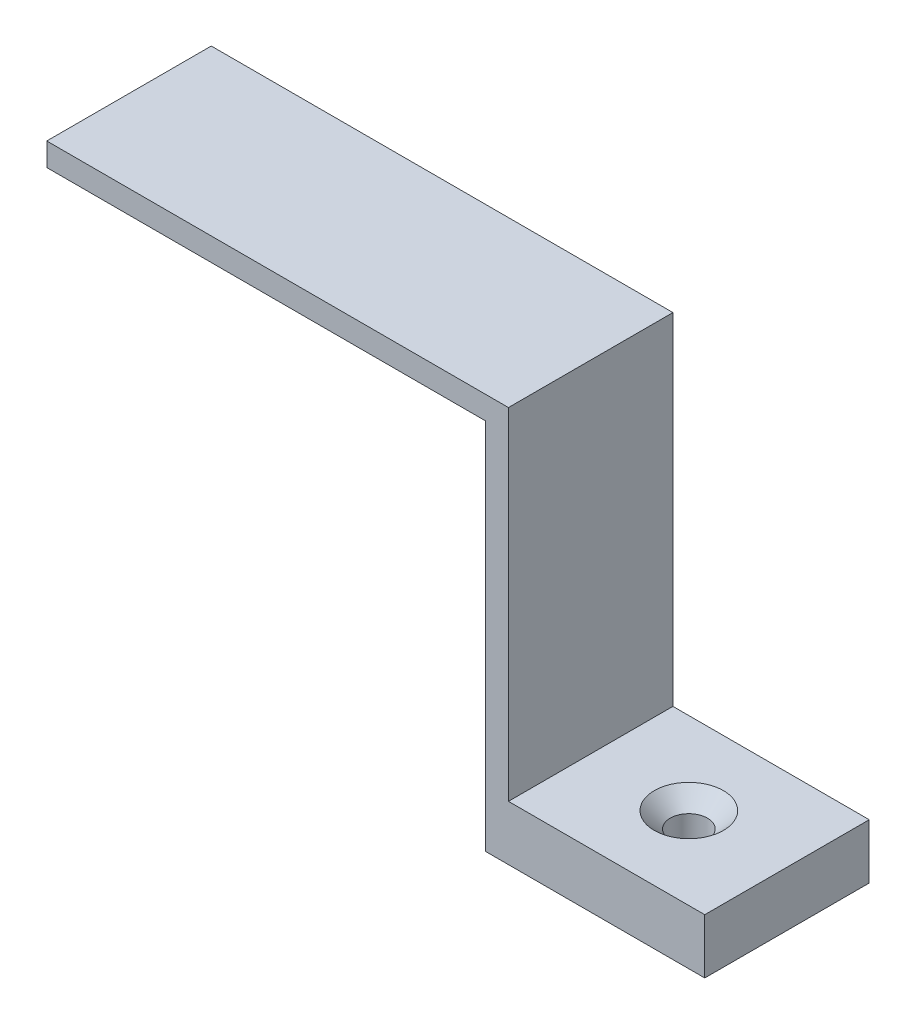
ISO-10303-21;
HEADER;
FILE_DESCRIPTION(('STEP AP214'),'2;1');
FILE_NAME('part.step','',(''),(''),'','','');
FILE_SCHEMA(('AUTOMOTIVE_DESIGN { 1 0 10303 214 1 1 1 1 }'));
ENDSEC;
DATA;
#1=APPLICATION_CONTEXT('core data for automotive mechanical design processes');
#2=APPLICATION_PROTOCOL_DEFINITION('international standard','automotive_design',2000,#1);
#3=PRODUCT_CONTEXT('',#1,'mechanical');
#4=PRODUCT('Part','Part','',(#3));
#5=PRODUCT_RELATED_PRODUCT_CATEGORY('part','',(#4));
#6=PRODUCT_DEFINITION_FORMATION('','',#4);
#7=PRODUCT_DEFINITION_CONTEXT('part definition',#1,'design');
#8=PRODUCT_DEFINITION('design','',#6,#7);
#9=PRODUCT_DEFINITION_SHAPE('','',#8);
#10=(LENGTH_UNIT() NAMED_UNIT(*) SI_UNIT(.MILLI.,.METRE.));
#11=(NAMED_UNIT(*) PLANE_ANGLE_UNIT() SI_UNIT($,.RADIAN.));
#12=(NAMED_UNIT(*) SI_UNIT($,.STERADIAN.) SOLID_ANGLE_UNIT());
#13=UNCERTAINTY_MEASURE_WITH_UNIT(LENGTH_MEASURE(1.E-05),#10,'distance_accuracy_value','');
#14=(GEOMETRIC_REPRESENTATION_CONTEXT(3) GLOBAL_UNCERTAINTY_ASSIGNED_CONTEXT((#13)) GLOBAL_UNIT_ASSIGNED_CONTEXT((#10,
#11,#12)) REPRESENTATION_CONTEXT('',''));
#15=CARTESIAN_POINT('',(0.,0.,0.));
#16=DIRECTION('',(0.,0.,1.));
#17=DIRECTION('',(1.,0.,0.));
#18=AXIS2_PLACEMENT_3D('',#15,#16,#17);
#19=CARTESIAN_POINT('',(-42.1778195773857,-18.7791958041958,15.));
#20=DIRECTION('',(0.,-1.,0.));
#21=DIRECTION('',(0.,0.,-1.));
#22=AXIS2_PLACEMENT_3D('',#19,#20,#21);
#23=PLANE('',#22);
#24=CARTESIAN_POINT('',(-33.2278195773857,-18.7791958041958,7.5));
#25=DIRECTION('',(0.,1.,0.));
#26=DIRECTION('',(0.,0.,1.));
#27=AXIS2_PLACEMENT_3D('',#24,#25,#26);
#28=CIRCLE('',#27,3.15);
#29=CARTESIAN_POINT('',(-33.2278195773857,-18.7791958041958,10.65));
#30=VERTEX_POINT('',#29);
#31=EDGE_CURVE('E182',#30,#30,#28,.T.);
#32=ORIENTED_EDGE('',*,*,#31,.F.);
#33=EDGE_LOOP('',(#32));
#34=FACE_BOUND('',#33,.T.);
#35=DIRECTION('',(-1.,0.,0.));
#36=VECTOR('',#35,1.);
#37=CARTESIAN_POINT('',(-42.1778195773857,-18.7791958041958,0.));
#38=LINE('',#37,#36);
#39=CARTESIAN_POINT('',(-24.2778195773857,-18.7791958041958,0.));
#40=VERTEX_POINT('',#39);
#41=CARTESIAN_POINT('',(-42.1778195773857,-18.7791958041958,0.));
#42=VERTEX_POINT('',#41);
#43=EDGE_CURVE('E129',#40,#42,#38,.T.);
#44=ORIENTED_EDGE('',*,*,#43,.T.);
#45=DIRECTION('',(0.,0.,-1.));
#46=VECTOR('',#45,1.);
#47=CARTESIAN_POINT('',(-42.1778195773857,-18.7791958041958,15.));
#48=LINE('',#47,#46);
#49=CARTESIAN_POINT('',(-42.1778195773857,-18.7791958041958,15.));
#50=VERTEX_POINT('',#49);
#51=EDGE_CURVE('E11',#50,#42,#48,.T.);
#52=ORIENTED_EDGE('',*,*,#51,.F.);
#53=DIRECTION('',(-1.,0.,0.));
#54=VECTOR('',#53,1.);
#55=CARTESIAN_POINT('',(-42.1778195773857,-18.7791958041958,15.));
#56=LINE('',#55,#54);
#57=CARTESIAN_POINT('',(-24.2778195773857,-18.7791958041958,15.));
#58=VERTEX_POINT('',#57);
#59=EDGE_CURVE('E144',#58,#50,#56,.T.);
#60=ORIENTED_EDGE('',*,*,#59,.F.);
#61=DIRECTION('',(0.,0.,-1.));
#62=VECTOR('',#61,1.);
#63=CARTESIAN_POINT('',(-24.2778195773857,-18.7791958041958,15.));
#64=LINE('',#63,#62);
#65=EDGE_CURVE('E125',#58,#40,#64,.T.);
#66=ORIENTED_EDGE('',*,*,#65,.T.);
#67=EDGE_LOOP('',(#44,#52,#60,#66));
#68=FACE_BOUND('',#67,.T.);
#69=ADVANCED_FACE('F33',(#34,#68),#23,.F.);
#70=CARTESIAN_POINT('',(-42.1778195773857,12.3208041958042,15.));
#71=DIRECTION('',(-1.,0.,0.));
#72=DIRECTION('',(0.,-1.,0.));
#73=AXIS2_PLACEMENT_3D('',#70,#71,#72);
#74=PLANE('',#73);
#75=DIRECTION('',(0.,1.,0.));
#76=VECTOR('',#75,1.);
#77=CARTESIAN_POINT('',(-42.1778195773857,12.3208041958042,0.));
#78=LINE('',#77,#76);
#79=CARTESIAN_POINT('',(-42.1778195773857,12.3208041958042,0.));
#80=VERTEX_POINT('',#79);
#81=EDGE_CURVE('E132',#42,#80,#78,.T.);
#82=ORIENTED_EDGE('',*,*,#81,.T.);
#83=DIRECTION('',(0.,0.,-1.));
#84=VECTOR('',#83,1.);
#85=CARTESIAN_POINT('',(-42.1778195773857,12.3208041958042,15.));
#86=LINE('',#85,#84);
#87=CARTESIAN_POINT('',(-42.1778195773857,12.3208041958042,15.));
#88=VERTEX_POINT('',#87);
#89=EDGE_CURVE('E41',#88,#80,#86,.T.);
#90=ORIENTED_EDGE('',*,*,#89,.F.);
#91=DIRECTION('',(0.,1.,0.));
#92=VECTOR('',#91,1.);
#93=CARTESIAN_POINT('',(-42.1778195773857,12.3208041958042,15.));
#94=LINE('',#93,#92);
#95=EDGE_CURVE('E92',#50,#88,#94,.T.);
#96=ORIENTED_EDGE('',*,*,#95,.F.);
#97=ORIENTED_EDGE('',*,*,#51,.T.);
#98=EDGE_LOOP('',(#82,#90,#96,#97));
#99=FACE_BOUND('',#98,.T.);
#100=ADVANCED_FACE('F190',(#99),#74,.F.);
#101=CARTESIAN_POINT('',(-84.2778195773857,12.3208041958042,15.));
#102=DIRECTION('',(0.,-1.,0.));
#103=DIRECTION('',(0.,0.,-1.));
#104=AXIS2_PLACEMENT_3D('',#101,#102,#103);
#105=PLANE('',#104);
#106=DIRECTION('',(-1.,0.,0.));
#107=VECTOR('',#106,1.);
#108=CARTESIAN_POINT('',(-84.2778195773857,12.3208041958042,0.));
#109=LINE('',#108,#107);
#110=CARTESIAN_POINT('',(-84.2778195773857,12.3208041958042,0.));
#111=VERTEX_POINT('',#110);
#112=EDGE_CURVE('E135',#80,#111,#109,.T.);
#113=ORIENTED_EDGE('',*,*,#112,.T.);
#114=DIRECTION('',(0.,0.,-1.));
#115=VECTOR('',#114,1.);
#116=CARTESIAN_POINT('',(-84.2778195773857,12.3208041958042,15.));
#117=LINE('',#116,#115);
#118=CARTESIAN_POINT('',(-84.2778195773857,12.3208041958042,15.));
#119=VERTEX_POINT('',#118);
#120=EDGE_CURVE('E151',#119,#111,#117,.T.);
#121=ORIENTED_EDGE('',*,*,#120,.F.);
#122=DIRECTION('',(-1.,0.,0.));
#123=VECTOR('',#122,1.);
#124=CARTESIAN_POINT('',(-84.2778195773857,12.3208041958042,15.));
#125=LINE('',#124,#123);
#126=EDGE_CURVE('E159',#88,#119,#125,.T.);
#127=ORIENTED_EDGE('',*,*,#126,.F.);
#128=ORIENTED_EDGE('',*,*,#89,.T.);
#129=EDGE_LOOP('',(#113,#121,#127,#128));
#130=FACE_BOUND('',#129,.T.);
#131=ADVANCED_FACE('F157',(#130),#105,.F.);
#132=CARTESIAN_POINT('',(-84.2778195773857,10.2208041958042,15.));
#133=DIRECTION('',(1.,0.,0.));
#134=DIRECTION('',(0.,0.,-1.));
#135=AXIS2_PLACEMENT_3D('',#132,#133,#134);
#136=PLANE('',#135);
#137=DIRECTION('',(0.,-1.,0.));
#138=VECTOR('',#137,1.);
#139=CARTESIAN_POINT('',(-84.2778195773857,10.2208041958042,0.));
#140=LINE('',#139,#138);
#141=CARTESIAN_POINT('',(-84.2778195773857,10.2208041958042,0.));
#142=VERTEX_POINT('',#141);
#143=EDGE_CURVE('E137',#111,#142,#140,.T.);
#144=ORIENTED_EDGE('',*,*,#143,.T.);
#145=DIRECTION('',(0.,0.,-1.));
#146=VECTOR('',#145,1.);
#147=CARTESIAN_POINT('',(-84.2778195773857,10.2208041958042,15.));
#148=LINE('',#147,#146);
#149=CARTESIAN_POINT('',(-84.2778195773857,10.2208041958042,15.));
#150=VERTEX_POINT('',#149);
#151=EDGE_CURVE('E148',#150,#142,#148,.T.);
#152=ORIENTED_EDGE('',*,*,#151,.F.);
#153=DIRECTION('',(0.,-1.,0.));
#154=VECTOR('',#153,1.);
#155=CARTESIAN_POINT('',(-84.2778195773857,10.2208041958042,15.));
#156=LINE('',#155,#154);
#157=EDGE_CURVE('E171',#119,#150,#156,.T.);
#158=ORIENTED_EDGE('',*,*,#157,.F.);
#159=ORIENTED_EDGE('',*,*,#120,.T.);
#160=EDGE_LOOP('',(#144,#152,#158,#159));
#161=FACE_BOUND('',#160,.T.);
#162=ADVANCED_FACE('F167',(#161),#136,.F.);
#163=CARTESIAN_POINT('',(-44.2778195773857,10.2208041958042,15.));
#164=DIRECTION('',(0.,1.,0.));
#165=DIRECTION('',(-1.,0.,0.));
#166=AXIS2_PLACEMENT_3D('',#163,#164,#165);
#167=PLANE('',#166);
#168=DIRECTION('',(1.,0.,0.));
#169=VECTOR('',#168,1.);
#170=CARTESIAN_POINT('',(-44.2778195773857,10.2208041958042,0.));
#171=LINE('',#170,#169);
#172=CARTESIAN_POINT('',(-44.2778195773857,10.2208041958042,0.));
#173=VERTEX_POINT('',#172);
#174=EDGE_CURVE('E139',#142,#173,#171,.T.);
#175=ORIENTED_EDGE('',*,*,#174,.T.);
#176=DIRECTION('',(0.,0.,-1.));
#177=VECTOR('',#176,1.);
#178=CARTESIAN_POINT('',(-44.2778195773857,10.2208041958042,15.));
#179=LINE('',#178,#177);
#180=CARTESIAN_POINT('',(-44.2778195773857,10.2208041958042,15.));
#181=VERTEX_POINT('',#180);
#182=EDGE_CURVE('E120',#181,#173,#179,.T.);
#183=ORIENTED_EDGE('',*,*,#182,.F.);
#184=DIRECTION('',(1.,0.,0.));
#185=VECTOR('',#184,1.);
#186=CARTESIAN_POINT('',(-44.2778195773857,10.2208041958042,15.));
#187=LINE('',#186,#185);
#188=EDGE_CURVE('E111',#150,#181,#187,.T.);
#189=ORIENTED_EDGE('',*,*,#188,.F.);
#190=ORIENTED_EDGE('',*,*,#151,.T.);
#191=EDGE_LOOP('',(#175,#183,#189,#190));
#192=FACE_BOUND('',#191,.T.);
#193=ADVANCED_FACE('F170',(#192),#167,.F.);
#194=CARTESIAN_POINT('',(-44.2778195773857,-23.7791958041958,15.));
#195=DIRECTION('',(1.,0.,0.));
#196=DIRECTION('',(0.,0.,-1.));
#197=AXIS2_PLACEMENT_3D('',#194,#195,#196);
#198=PLANE('',#197);
#199=DIRECTION('',(0.,-1.,0.));
#200=VECTOR('',#199,1.);
#201=CARTESIAN_POINT('',(-44.2778195773857,-23.7791958041958,0.));
#202=LINE('',#201,#200);
#203=CARTESIAN_POINT('',(-44.2778195773857,-23.7791958041958,0.));
#204=VERTEX_POINT('',#203);
#205=EDGE_CURVE('E119',#173,#204,#202,.T.);
#206=ORIENTED_EDGE('',*,*,#205,.T.);
#207=DIRECTION('',(0.,0.,-1.));
#208=VECTOR('',#207,1.);
#209=CARTESIAN_POINT('',(-44.2778195773857,-23.7791958041958,15.));
#210=LINE('',#209,#208);
#211=CARTESIAN_POINT('',(-44.2778195773857,-23.7791958041958,15.));
#212=VERTEX_POINT('',#211);
#213=EDGE_CURVE('E116',#212,#204,#210,.T.);
#214=ORIENTED_EDGE('',*,*,#213,.F.);
#215=DIRECTION('',(0.,-1.,0.));
#216=VECTOR('',#215,1.);
#217=CARTESIAN_POINT('',(-44.2778195773857,-23.7791958041958,15.));
#218=LINE('',#217,#216);
#219=EDGE_CURVE('E105',#181,#212,#218,.T.);
#220=ORIENTED_EDGE('',*,*,#219,.F.);
#221=ORIENTED_EDGE('',*,*,#182,.T.);
#222=EDGE_LOOP('',(#206,#214,#220,#221));
#223=FACE_BOUND('',#222,.T.);
#224=ADVANCED_FACE('F117',(#223),#198,.F.);
#225=CARTESIAN_POINT('',(-24.2778195773857,-23.7791958041958,15.));
#226=DIRECTION('',(0.,1.,0.));
#227=DIRECTION('',(-1.,0.,0.));
#228=AXIS2_PLACEMENT_3D('',#225,#226,#227);
#229=PLANE('',#228);
#230=CARTESIAN_POINT('',(-33.2278195773857,-23.7791958041958,7.5));
#231=DIRECTION('',(0.,1.,0.));
#232=DIRECTION('',(0.,0.,1.));
#233=AXIS2_PLACEMENT_3D('',#230,#231,#232);
#234=CIRCLE('',#233,1.7);
#235=CARTESIAN_POINT('',(-33.2278195773857,-23.7791958041958,9.2));
#236=VERTEX_POINT('',#235);
#237=EDGE_CURVE('E133',#236,#236,#234,.T.);
#238=ORIENTED_EDGE('',*,*,#237,.T.);
#239=EDGE_LOOP('',(#238));
#240=FACE_BOUND('',#239,.T.);
#241=DIRECTION('',(1.,0.,0.));
#242=VECTOR('',#241,1.);
#243=CARTESIAN_POINT('',(-24.2778195773857,-23.7791958041958,0.));
#244=LINE('',#243,#242);
#245=CARTESIAN_POINT('',(-24.2778195773857,-23.7791958041958,0.));
#246=VERTEX_POINT('',#245);
#247=EDGE_CURVE('E78',#204,#246,#244,.T.);
#248=ORIENTED_EDGE('',*,*,#247,.T.);
#249=DIRECTION('',(0.,0.,-1.));
#250=VECTOR('',#249,1.);
#251=CARTESIAN_POINT('',(-24.2778195773857,-23.7791958041958,15.));
#252=LINE('',#251,#250);
#253=CARTESIAN_POINT('',(-24.2778195773857,-23.7791958041958,15.));
#254=VERTEX_POINT('',#253);
#255=EDGE_CURVE('E121',#254,#246,#252,.T.);
#256=ORIENTED_EDGE('',*,*,#255,.F.);
#257=DIRECTION('',(1.,0.,0.));
#258=VECTOR('',#257,1.);
#259=CARTESIAN_POINT('',(-24.2778195773857,-23.7791958041958,15.));
#260=LINE('',#259,#258);
#261=EDGE_CURVE('E109',#212,#254,#260,.T.);
#262=ORIENTED_EDGE('',*,*,#261,.F.);
#263=ORIENTED_EDGE('',*,*,#213,.T.);
#264=EDGE_LOOP('',(#248,#256,#262,#263));
#265=FACE_BOUND('',#264,.T.);
#266=ADVANCED_FACE('F123',(#240,#265),#229,.F.);
#267=CARTESIAN_POINT('',(-24.2778195773857,-18.7791958041958,15.));
#268=DIRECTION('',(-1.,0.,0.));
#269=DIRECTION('',(0.,-1.,0.));
#270=AXIS2_PLACEMENT_3D('',#267,#268,#269);
#271=PLANE('',#270);
#272=DIRECTION('',(0.,1.,0.));
#273=VECTOR('',#272,1.);
#274=CARTESIAN_POINT('',(-24.2778195773857,-18.7791958041958,0.));
#275=LINE('',#274,#273);
#276=EDGE_CURVE('E84',#246,#40,#275,.T.);
#277=ORIENTED_EDGE('',*,*,#276,.T.);
#278=ORIENTED_EDGE('',*,*,#65,.F.);
#279=DIRECTION('',(0.,1.,0.));
#280=VECTOR('',#279,1.);
#281=CARTESIAN_POINT('',(-24.2778195773857,-18.7791958041958,15.));
#282=LINE('',#281,#280);
#283=EDGE_CURVE('E49',#254,#58,#282,.T.);
#284=ORIENTED_EDGE('',*,*,#283,.F.);
#285=ORIENTED_EDGE('',*,*,#255,.T.);
#286=EDGE_LOOP('',(#277,#278,#284,#285));
#287=FACE_BOUND('',#286,.T.);
#288=ADVANCED_FACE('F193',(#287),#271,.F.);
#289=CARTESIAN_POINT('',(0.,0.,15.));
#290=DIRECTION('',(0.,0.,-1.));
#291=DIRECTION('',(-1.,0.,0.));
#292=AXIS2_PLACEMENT_3D('',#289,#290,#291);
#293=PLANE('',#292);
#294=ORIENTED_EDGE('',*,*,#59,.T.);
#295=ORIENTED_EDGE('',*,*,#95,.T.);
#296=ORIENTED_EDGE('',*,*,#126,.T.);
#297=ORIENTED_EDGE('',*,*,#157,.T.);
#298=ORIENTED_EDGE('',*,*,#188,.T.);
#299=ORIENTED_EDGE('',*,*,#219,.T.);
#300=ORIENTED_EDGE('',*,*,#261,.T.);
#301=ORIENTED_EDGE('',*,*,#283,.T.);
#302=EDGE_LOOP('',(#294,#295,#296,#297,#298,#299,#300,#301));
#303=FACE_BOUND('',#302,.T.);
#304=ADVANCED_FACE('F107',(#303),#293,.F.);
#305=CARTESIAN_POINT('',(0.,0.,0.));
#306=DIRECTION('',(0.,0.,-1.));
#307=DIRECTION('',(-1.,0.,0.));
#308=AXIS2_PLACEMENT_3D('',#305,#306,#307);
#309=PLANE('',#308);
#310=ORIENTED_EDGE('',*,*,#43,.F.);
#311=ORIENTED_EDGE('',*,*,#276,.F.);
#312=ORIENTED_EDGE('',*,*,#247,.F.);
#313=ORIENTED_EDGE('',*,*,#205,.F.);
#314=ORIENTED_EDGE('',*,*,#174,.F.);
#315=ORIENTED_EDGE('',*,*,#143,.F.);
#316=ORIENTED_EDGE('',*,*,#112,.F.);
#317=ORIENTED_EDGE('',*,*,#81,.F.);
#318=EDGE_LOOP('',(#310,#311,#312,#313,#314,#315,#316,#317));
#319=FACE_BOUND('',#318,.T.);
#320=ADVANCED_FACE('F163',(#319),#309,.T.);
#321=CARTESIAN_POINT('',(-33.2278195773857,-18.7791958041958,7.5));
#322=DIRECTION('',(0.,1.,0.));
#323=DIRECTION('',(0.,0.,1.));
#324=AXIS2_PLACEMENT_3D('',#321,#322,#323);
#325=CYLINDRICAL_SURFACE('',#324,1.7);
#326=ORIENTED_EDGE('',*,*,#237,.F.);
#327=EDGE_LOOP('',(#326));
#328=FACE_BOUND('',#327,.T.);
#329=CARTESIAN_POINT('',(-33.2278195773857,-20.2291958041958,7.5));
#330=DIRECTION('',(0.,1.,0.));
#331=DIRECTION('',(0.,0.,1.));
#332=AXIS2_PLACEMENT_3D('',#329,#330,#331);
#333=CIRCLE('',#332,1.7);
#334=CARTESIAN_POINT('',(-33.2278195773857,-20.2291958041958,9.2));
#335=VERTEX_POINT('',#334);
#336=EDGE_CURVE('E179',#335,#335,#333,.T.);
#337=ORIENTED_EDGE('',*,*,#336,.T.);
#338=EDGE_LOOP('',(#337));
#339=FACE_BOUND('',#338,.T.);
#340=ADVANCED_FACE('F246',(#328,#339),#325,.F.);
#341=CARTESIAN_POINT('',(-33.2278195773857,-18.7791958041958,7.5));
#342=DIRECTION('',(0.,1.,0.));
#343=DIRECTION('',(0.,0.,1.));
#344=AXIS2_PLACEMENT_3D('',#341,#342,#343);
#345=CONICAL_SURFACE('',#344,3.15,0.78539816339745);
#346=ORIENTED_EDGE('',*,*,#336,.F.);
#347=EDGE_LOOP('',(#346));
#348=FACE_BOUND('',#347,.T.);
#349=ORIENTED_EDGE('',*,*,#31,.T.);
#350=EDGE_LOOP('',(#349));
#351=FACE_BOUND('',#350,.T.);
#352=ADVANCED_FACE('F186',(#348,#351),#345,.F.);
#353=CLOSED_SHELL('',(#69,#100,#131,#162,#193,#224,#266,#288,#304,#320,#340,#352));
#354=MANIFOLD_SOLID_BREP('B2',#353);
#355=ADVANCED_BREP_SHAPE_REPRESENTATION('',(#18,#354),#14);
#356=SHAPE_DEFINITION_REPRESENTATION(#9,#355);
ENDSEC;
END-ISO-10303-21;
